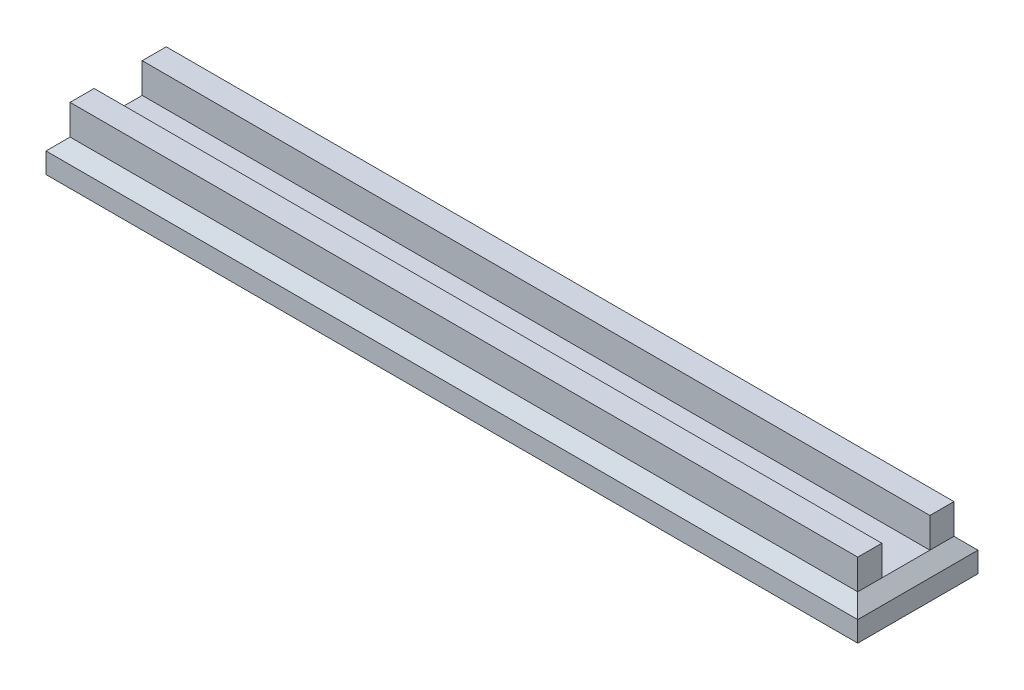
ISO-10303-21;
HEADER;
FILE_DESCRIPTION(('STEP AP214'),'2;1');
FILE_NAME('part.step','',(''),(''),'','','');
FILE_SCHEMA(('AUTOMOTIVE_DESIGN { 1 0 10303 214 1 1 1 1 }'));
ENDSEC;
DATA;
#1=APPLICATION_CONTEXT('core data for automotive mechanical design processes');
#2=APPLICATION_PROTOCOL_DEFINITION('international standard','automotive_design',2000,#1);
#3=PRODUCT_CONTEXT('',#1,'mechanical');
#4=PRODUCT('Part','Part','',(#3));
#5=PRODUCT_RELATED_PRODUCT_CATEGORY('part','',(#4));
#6=PRODUCT_DEFINITION_FORMATION('','',#4);
#7=PRODUCT_DEFINITION_CONTEXT('part definition',#1,'design');
#8=PRODUCT_DEFINITION('design','',#6,#7);
#9=PRODUCT_DEFINITION_SHAPE('','',#8);
#10=(LENGTH_UNIT() NAMED_UNIT(*) SI_UNIT(.MILLI.,.METRE.));
#11=(NAMED_UNIT(*) PLANE_ANGLE_UNIT() SI_UNIT($,.RADIAN.));
#12=(NAMED_UNIT(*) SI_UNIT($,.STERADIAN.) SOLID_ANGLE_UNIT());
#13=UNCERTAINTY_MEASURE_WITH_UNIT(LENGTH_MEASURE(1.E-05),#10,'distance_accuracy_value','');
#14=(GEOMETRIC_REPRESENTATION_CONTEXT(3) GLOBAL_UNCERTAINTY_ASSIGNED_CONTEXT((#13)) GLOBAL_UNIT_ASSIGNED_CONTEXT((#10,
#11,#12)) REPRESENTATION_CONTEXT('',''));
#15=CARTESIAN_POINT('',(0.,0.,0.));
#16=DIRECTION('',(0.,0.,1.));
#17=DIRECTION('',(1.,0.,0.));
#18=AXIS2_PLACEMENT_3D('',#15,#16,#17);
#19=CARTESIAN_POINT('',(0.,5.4,0.));
#20=DIRECTION('',(0.,-1.,0.));
#21=DIRECTION('',(0.,0.,-1.));
#22=AXIS2_PLACEMENT_3D('',#19,#20,#21);
#23=PLANE('',#22);
#24=DIRECTION('',(-1.,0.,0.));
#25=VECTOR('',#24,1.);
#26=CARTESIAN_POINT('',(-65.5,5.4,4.));
#27=LINE('',#26,#25);
#28=CARTESIAN_POINT('',(65.5,5.4,4.));
#29=VERTEX_POINT('',#28);
#30=CARTESIAN_POINT('',(-65.5,5.4,4.));
#31=VERTEX_POINT('',#30);
#32=EDGE_CURVE('E71',#29,#31,#27,.T.);
#33=ORIENTED_EDGE('',*,*,#32,.F.);
#34=DIRECTION('',(0.,0.,-1.));
#35=VECTOR('',#34,1.);
#36=CARTESIAN_POINT('',(65.5,5.4,0.));
#37=LINE('',#36,#35);
#38=CARTESIAN_POINT('',(65.5,5.4,-4.));
#39=VERTEX_POINT('',#38);
#40=EDGE_CURVE('E145',#29,#39,#37,.T.);
#41=ORIENTED_EDGE('',*,*,#40,.T.);
#42=DIRECTION('',(1.,0.,0.));
#43=VECTOR('',#42,1.);
#44=CARTESIAN_POINT('',(-65.5,5.4,-4.));
#45=LINE('',#44,#43);
#46=CARTESIAN_POINT('',(-65.5,5.4,-4.));
#47=VERTEX_POINT('',#46);
#48=EDGE_CURVE('E196',#47,#39,#45,.T.);
#49=ORIENTED_EDGE('',*,*,#48,.F.);
#50=DIRECTION('',(0.,0.,1.));
#51=VECTOR('',#50,1.);
#52=CARTESIAN_POINT('',(-65.5,5.4,0.));
#53=LINE('',#52,#51);
#54=EDGE_CURVE('E273',#47,#31,#53,.T.);
#55=ORIENTED_EDGE('',*,*,#54,.T.);
#56=EDGE_LOOP('',(#33,#41,#49,#55));
#57=FACE_BOUND('',#56,.T.);
#58=ADVANCED_FACE('F45',(#57),#23,.F.);
#59=CARTESIAN_POINT('',(67.5,5.4,10.));
#60=DIRECTION('',(-1.,0.,0.));
#61=DIRECTION('',(0.,0.,1.));
#62=AXIS2_PLACEMENT_3D('',#59,#60,#61);
#63=PLANE('',#62);
#64=DIRECTION('',(0.,-1.,0.));
#65=VECTOR('',#64,1.);
#66=CARTESIAN_POINT('',(67.5,5.4,-10.));
#67=LINE('',#66,#65);
#68=CARTESIAN_POINT('',(67.5,3.39999999999999,-10.));
#69=VERTEX_POINT('',#68);
#70=CARTESIAN_POINT('',(67.5,0.,-10.));
#71=VERTEX_POINT('',#70);
#72=EDGE_CURVE('E267',#69,#71,#67,.T.);
#73=ORIENTED_EDGE('',*,*,#72,.F.);
#74=DIRECTION('',(0.,0.,1.));
#75=VECTOR('',#74,1.);
#76=CARTESIAN_POINT('',(67.5,3.39999999999998,10.));
#77=LINE('',#76,#75);
#78=CARTESIAN_POINT('',(67.5,3.39999999999999,10.));
#79=VERTEX_POINT('',#78);
#80=EDGE_CURVE('E11',#69,#79,#77,.T.);
#81=ORIENTED_EDGE('',*,*,#80,.T.);
#82=DIRECTION('',(0.,-1.,0.));
#83=VECTOR('',#82,1.);
#84=CARTESIAN_POINT('',(67.5,5.4,10.));
#85=LINE('',#84,#83);
#86=CARTESIAN_POINT('',(67.5,0.,10.));
#87=VERTEX_POINT('',#86);
#88=EDGE_CURVE('E258',#79,#87,#85,.T.);
#89=ORIENTED_EDGE('',*,*,#88,.T.);
#90=DIRECTION('',(0.,0.,-1.));
#91=VECTOR('',#90,1.);
#92=CARTESIAN_POINT('',(67.5,0.,10.));
#93=LINE('',#92,#91);
#94=EDGE_CURVE('E242',#87,#71,#93,.T.);
#95=ORIENTED_EDGE('',*,*,#94,.T.);
#96=EDGE_LOOP('',(#73,#81,#89,#95));
#97=FACE_BOUND('',#96,.T.);
#98=ADVANCED_FACE('F301',(#97),#63,.F.);
#99=CARTESIAN_POINT('',(-67.5,5.4,-10.));
#100=DIRECTION('',(0.,0.,1.));
#101=DIRECTION('',(1.,0.,0.));
#102=AXIS2_PLACEMENT_3D('',#99,#100,#101);
#103=PLANE('',#102);
#104=DIRECTION('',(0.,-1.,0.));
#105=VECTOR('',#104,1.);
#106=CARTESIAN_POINT('',(-67.5,5.4,-10.));
#107=LINE('',#106,#105);
#108=CARTESIAN_POINT('',(-67.5,3.39999999999999,-10.));
#109=VERTEX_POINT('',#108);
#110=CARTESIAN_POINT('',(-67.5,0.,-10.));
#111=VERTEX_POINT('',#110);
#112=EDGE_CURVE('E264',#109,#111,#107,.T.);
#113=ORIENTED_EDGE('',*,*,#112,.F.);
#114=DIRECTION('',(1.,0.,0.));
#115=VECTOR('',#114,1.);
#116=CARTESIAN_POINT('',(-67.5,3.39999999999998,-10.));
#117=LINE('',#116,#115);
#118=EDGE_CURVE('E56',#109,#69,#117,.T.);
#119=ORIENTED_EDGE('',*,*,#118,.T.);
#120=ORIENTED_EDGE('',*,*,#72,.T.);
#121=DIRECTION('',(-1.,0.,0.));
#122=VECTOR('',#121,1.);
#123=CARTESIAN_POINT('',(-67.5,0.,-10.));
#124=LINE('',#123,#122);
#125=EDGE_CURVE('E246',#71,#111,#124,.T.);
#126=ORIENTED_EDGE('',*,*,#125,.T.);
#127=EDGE_LOOP('',(#113,#119,#120,#126));
#128=FACE_BOUND('',#127,.T.);
#129=ADVANCED_FACE('F298',(#128),#103,.F.);
#130=CARTESIAN_POINT('',(-67.5,5.4,10.));
#131=DIRECTION('',(1.,0.,0.));
#132=DIRECTION('',(0.,0.,-1.));
#133=AXIS2_PLACEMENT_3D('',#130,#131,#132);
#134=PLANE('',#133);
#135=DIRECTION('',(0.,-1.,0.));
#136=VECTOR('',#135,1.);
#137=CARTESIAN_POINT('',(-67.5,5.4,10.));
#138=LINE('',#137,#136);
#139=CARTESIAN_POINT('',(-67.5,3.39999999999999,10.));
#140=VERTEX_POINT('',#139);
#141=CARTESIAN_POINT('',(-67.5,0.,10.));
#142=VERTEX_POINT('',#141);
#143=EDGE_CURVE('E261',#140,#142,#138,.T.);
#144=ORIENTED_EDGE('',*,*,#143,.F.);
#145=DIRECTION('',(0.,0.,-1.));
#146=VECTOR('',#145,1.);
#147=CARTESIAN_POINT('',(-67.5,3.39999999999998,10.));
#148=LINE('',#147,#146);
#149=EDGE_CURVE('E279',#140,#109,#148,.T.);
#150=ORIENTED_EDGE('',*,*,#149,.T.);
#151=ORIENTED_EDGE('',*,*,#112,.T.);
#152=DIRECTION('',(0.,0.,1.));
#153=VECTOR('',#152,1.);
#154=CARTESIAN_POINT('',(-67.5,0.,10.));
#155=LINE('',#154,#153);
#156=EDGE_CURVE('E250',#111,#142,#155,.T.);
#157=ORIENTED_EDGE('',*,*,#156,.T.);
#158=EDGE_LOOP('',(#144,#150,#151,#157));
#159=FACE_BOUND('',#158,.T.);
#160=ADVANCED_FACE('F310',(#159),#134,.F.);
#161=CARTESIAN_POINT('',(-67.5,5.4,10.));
#162=DIRECTION('',(0.,0.,-1.));
#163=DIRECTION('',(-1.,0.,0.));
#164=AXIS2_PLACEMENT_3D('',#161,#162,#163);
#165=PLANE('',#164);
#166=ORIENTED_EDGE('',*,*,#88,.F.);
#167=DIRECTION('',(-1.,0.,0.));
#168=VECTOR('',#167,1.);
#169=CARTESIAN_POINT('',(-67.5,3.39999999999998,10.));
#170=LINE('',#169,#168);
#171=EDGE_CURVE('E161',#79,#140,#170,.T.);
#172=ORIENTED_EDGE('',*,*,#171,.T.);
#173=ORIENTED_EDGE('',*,*,#143,.T.);
#174=DIRECTION('',(1.,0.,0.));
#175=VECTOR('',#174,1.);
#176=CARTESIAN_POINT('',(-67.5,0.,10.));
#177=LINE('',#176,#175);
#178=EDGE_CURVE('E254',#142,#87,#177,.T.);
#179=ORIENTED_EDGE('',*,*,#178,.T.);
#180=EDGE_LOOP('',(#166,#172,#173,#179));
#181=FACE_BOUND('',#180,.T.);
#182=ADVANCED_FACE('F312',(#181),#165,.F.);
#183=CARTESIAN_POINT('',(0.,0.,0.));
#184=DIRECTION('',(0.,-1.,0.));
#185=DIRECTION('',(0.,0.,-1.));
#186=AXIS2_PLACEMENT_3D('',#183,#184,#185);
#187=PLANE('',#186);
#188=ORIENTED_EDGE('',*,*,#94,.F.);
#189=ORIENTED_EDGE('',*,*,#178,.F.);
#190=ORIENTED_EDGE('',*,*,#156,.F.);
#191=ORIENTED_EDGE('',*,*,#125,.F.);
#192=EDGE_LOOP('',(#188,#189,#190,#191));
#193=FACE_BOUND('',#192,.T.);
#194=ADVANCED_FACE('F306',(#193),#187,.T.);
#195=CARTESIAN_POINT('',(0.,5.4,-8.));
#196=DIRECTION('',(0.,-0.707106781186545,0.70710678118655));
#197=DIRECTION('',(-1.,0.,0.));
#198=AXIS2_PLACEMENT_3D('',#195,#196,#197);
#199=PLANE('',#198);
#200=DIRECTION('',(-0.577350269189625,0.577350269189629,0.577350269189624));
#201=VECTOR('',#200,1.);
#202=CARTESIAN_POINT('',(62.8333333333334,8.06666666666667,-5.33333333333335));
#203=LINE('',#202,#201);
#204=CARTESIAN_POINT('',(65.5,5.4,-8.));
#205=VERTEX_POINT('',#204);
#206=EDGE_CURVE('E285',#69,#205,#203,.T.);
#207=ORIENTED_EDGE('',*,*,#206,.F.);
#208=ORIENTED_EDGE('',*,*,#118,.F.);
#209=DIRECTION('',(0.577350269189625,0.577350269189629,0.577350269189624));
#210=VECTOR('',#209,1.);
#211=CARTESIAN_POINT('',(-43.6666666666667,27.2333333333334,13.8333333333332));
#212=LINE('',#211,#210);
#213=CARTESIAN_POINT('',(-65.5,5.4,-8.));
#214=VERTEX_POINT('',#213);
#215=EDGE_CURVE('E50',#214,#109,#212,.F.);
#216=ORIENTED_EDGE('',*,*,#215,.F.);
#217=DIRECTION('',(-1.,0.,0.));
#218=VECTOR('',#217,1.);
#219=CARTESIAN_POINT('',(0.,5.4,-8.));
#220=LINE('',#219,#218);
#221=EDGE_CURVE('E151',#205,#214,#220,.T.);
#222=ORIENTED_EDGE('',*,*,#221,.F.);
#223=EDGE_LOOP('',(#207,#208,#216,#222));
#224=FACE_BOUND('',#223,.T.);
#225=ADVANCED_FACE('F48',(#224),#199,.F.);
#226=CARTESIAN_POINT('',(-65.5,5.4,0.));
#227=DIRECTION('',(0.70710678118655,-0.707106781186545,0.));
#228=DIRECTION('',(0.,0.,1.));
#229=AXIS2_PLACEMENT_3D('',#226,#227,#228);
#230=PLANE('',#229);
#231=ORIENTED_EDGE('',*,*,#215,.T.);
#232=ORIENTED_EDGE('',*,*,#149,.F.);
#233=DIRECTION('',(0.577350269189625,0.577350269189629,-0.577350269189624));
#234=VECTOR('',#233,1.);
#235=CARTESIAN_POINT('',(-62.8333333333333,8.06666666666667,5.33333333333335));
#236=LINE('',#235,#234);
#237=CARTESIAN_POINT('',(-65.5,5.4,8.));
#238=VERTEX_POINT('',#237);
#239=EDGE_CURVE('E163',#238,#140,#236,.F.);
#240=ORIENTED_EDGE('',*,*,#239,.F.);
#241=DIRECTION('',(0.,0.,1.));
#242=VECTOR('',#241,1.);
#243=CARTESIAN_POINT('',(-65.5,5.4,8.));
#244=LINE('',#243,#242);
#245=EDGE_CURVE('E64',#31,#238,#244,.T.);
#246=ORIENTED_EDGE('',*,*,#245,.F.);
#247=ORIENTED_EDGE('',*,*,#54,.F.);
#248=EDGE_CURVE('E174',#214,#47,#53,.T.);
#249=ORIENTED_EDGE('',*,*,#248,.F.);
#250=EDGE_LOOP('',(#231,#232,#240,#246,#247,#249));
#251=FACE_BOUND('',#250,.T.);
#252=ADVANCED_FACE('F292',(#251),#230,.F.);
#253=CARTESIAN_POINT('',(65.5,5.4,0.));
#254=DIRECTION('',(-0.70710678118655,-0.707106781186545,0.));
#255=DIRECTION('',(0.,0.,-1.));
#256=AXIS2_PLACEMENT_3D('',#253,#254,#255);
#257=PLANE('',#256);
#258=ORIENTED_EDGE('',*,*,#206,.T.);
#259=DIRECTION('',(0.,0.,-1.));
#260=VECTOR('',#259,1.);
#261=CARTESIAN_POINT('',(65.5,5.4,-8.));
#262=LINE('',#261,#260);
#263=EDGE_CURVE('E212',#39,#205,#262,.T.);
#264=ORIENTED_EDGE('',*,*,#263,.F.);
#265=ORIENTED_EDGE('',*,*,#40,.F.);
#266=CARTESIAN_POINT('',(65.5,5.4,8.));
#267=VERTEX_POINT('',#266);
#268=EDGE_CURVE('E138',#267,#29,#37,.T.);
#269=ORIENTED_EDGE('',*,*,#268,.F.);
#270=DIRECTION('',(0.577350269189625,-0.577350269189629,0.577350269189624));
#271=VECTOR('',#270,1.);
#272=CARTESIAN_POINT('',(62.8333333333334,8.06666666666667,5.33333333333335));
#273=LINE('',#272,#271);
#274=EDGE_CURVE('E143',#79,#267,#273,.F.);
#275=ORIENTED_EDGE('',*,*,#274,.F.);
#276=ORIENTED_EDGE('',*,*,#80,.F.);
#277=EDGE_LOOP('',(#258,#264,#265,#269,#275,#276));
#278=FACE_BOUND('',#277,.T.);
#279=ADVANCED_FACE('F141',(#278),#257,.F.);
#280=CARTESIAN_POINT('',(0.,5.4,8.));
#281=DIRECTION('',(0.,-0.707106781186545,-0.70710678118655));
#282=DIRECTION('',(1.,0.,0.));
#283=AXIS2_PLACEMENT_3D('',#280,#281,#282);
#284=PLANE('',#283);
#285=ORIENTED_EDGE('',*,*,#239,.T.);
#286=ORIENTED_EDGE('',*,*,#171,.F.);
#287=ORIENTED_EDGE('',*,*,#274,.T.);
#288=DIRECTION('',(1.,0.,0.));
#289=VECTOR('',#288,1.);
#290=CARTESIAN_POINT('',(0.,5.4,8.));
#291=LINE('',#290,#289);
#292=EDGE_CURVE('E158',#238,#267,#291,.T.);
#293=ORIENTED_EDGE('',*,*,#292,.F.);
#294=EDGE_LOOP('',(#285,#286,#287,#293));
#295=FACE_BOUND('',#294,.T.);
#296=ADVANCED_FACE('F157',(#295),#284,.F.);
#297=CARTESIAN_POINT('',(-65.5,10.4,-8.));
#298=DIRECTION('',(1.,0.,0.));
#299=DIRECTION('',(0.,0.,-1.));
#300=AXIS2_PLACEMENT_3D('',#297,#298,#299);
#301=PLANE('',#300);
#302=ORIENTED_EDGE('',*,*,#248,.T.);
#303=DIRECTION('',(0.,-1.,0.));
#304=VECTOR('',#303,1.);
#305=CARTESIAN_POINT('',(-65.5,10.4,-4.));
#306=LINE('',#305,#304);
#307=CARTESIAN_POINT('',(-65.5,10.4,-4.));
#308=VERTEX_POINT('',#307);
#309=EDGE_CURVE('E164',#308,#47,#306,.T.);
#310=ORIENTED_EDGE('',*,*,#309,.F.);
#311=DIRECTION('',(0.,0.,1.));
#312=VECTOR('',#311,1.);
#313=CARTESIAN_POINT('',(-65.5,10.4,-8.));
#314=LINE('',#313,#312);
#315=CARTESIAN_POINT('',(-65.5,10.4,-8.));
#316=VERTEX_POINT('',#315);
#317=EDGE_CURVE('E207',#316,#308,#314,.T.);
#318=ORIENTED_EDGE('',*,*,#317,.F.);
#319=DIRECTION('',(0.,-1.,0.));
#320=VECTOR('',#319,1.);
#321=CARTESIAN_POINT('',(-65.5,10.4,-8.));
#322=LINE('',#321,#320);
#323=EDGE_CURVE('E221',#316,#214,#322,.T.);
#324=ORIENTED_EDGE('',*,*,#323,.T.);
#325=EDGE_LOOP('',(#302,#310,#318,#324));
#326=FACE_BOUND('',#325,.T.);
#327=ADVANCED_FACE('F328',(#326),#301,.F.);
#328=CARTESIAN_POINT('',(-65.5,10.4,-4.));
#329=DIRECTION('',(0.,0.,-1.));
#330=DIRECTION('',(-1.,0.,0.));
#331=AXIS2_PLACEMENT_3D('',#328,#329,#330);
#332=PLANE('',#331);
#333=ORIENTED_EDGE('',*,*,#48,.T.);
#334=DIRECTION('',(0.,-1.,0.));
#335=VECTOR('',#334,1.);
#336=CARTESIAN_POINT('',(65.5,10.4,-4.));
#337=LINE('',#336,#335);
#338=CARTESIAN_POINT('',(65.5,10.4,-4.));
#339=VERTEX_POINT('',#338);
#340=EDGE_CURVE('E235',#339,#39,#337,.T.);
#341=ORIENTED_EDGE('',*,*,#340,.F.);
#342=DIRECTION('',(1.,0.,0.));
#343=VECTOR('',#342,1.);
#344=CARTESIAN_POINT('',(-65.5,10.4,-4.));
#345=LINE('',#344,#343);
#346=EDGE_CURVE('E211',#308,#339,#345,.T.);
#347=ORIENTED_EDGE('',*,*,#346,.F.);
#348=ORIENTED_EDGE('',*,*,#309,.T.);
#349=EDGE_LOOP('',(#333,#341,#347,#348));
#350=FACE_BOUND('',#349,.T.);
#351=ADVANCED_FACE('F331',(#350),#332,.F.);
#352=CARTESIAN_POINT('',(65.5,10.4,-8.));
#353=DIRECTION('',(-1.,0.,0.));
#354=DIRECTION('',(0.,0.,1.));
#355=AXIS2_PLACEMENT_3D('',#352,#353,#354);
#356=PLANE('',#355);
#357=ORIENTED_EDGE('',*,*,#263,.T.);
#358=DIRECTION('',(0.,-1.,0.));
#359=VECTOR('',#358,1.);
#360=CARTESIAN_POINT('',(65.5,10.4,-8.));
#361=LINE('',#360,#359);
#362=CARTESIAN_POINT('',(65.5,10.4,-8.));
#363=VERTEX_POINT('',#362);
#364=EDGE_CURVE('E231',#363,#205,#361,.T.);
#365=ORIENTED_EDGE('',*,*,#364,.F.);
#366=DIRECTION('',(0.,0.,-1.));
#367=VECTOR('',#366,1.);
#368=CARTESIAN_POINT('',(65.5,10.4,-8.));
#369=LINE('',#368,#367);
#370=EDGE_CURVE('E215',#339,#363,#369,.T.);
#371=ORIENTED_EDGE('',*,*,#370,.F.);
#372=ORIENTED_EDGE('',*,*,#340,.T.);
#373=EDGE_LOOP('',(#357,#365,#371,#372));
#374=FACE_BOUND('',#373,.T.);
#375=ADVANCED_FACE('F335',(#374),#356,.F.);
#376=CARTESIAN_POINT('',(-65.5,10.4,-8.));
#377=DIRECTION('',(0.,0.,1.));
#378=DIRECTION('',(1.,0.,0.));
#379=AXIS2_PLACEMENT_3D('',#376,#377,#378);
#380=PLANE('',#379);
#381=ORIENTED_EDGE('',*,*,#221,.T.);
#382=ORIENTED_EDGE('',*,*,#323,.F.);
#383=DIRECTION('',(-1.,0.,0.));
#384=VECTOR('',#383,1.);
#385=CARTESIAN_POINT('',(-65.5,10.4,-8.));
#386=LINE('',#385,#384);
#387=EDGE_CURVE('E218',#363,#316,#386,.T.);
#388=ORIENTED_EDGE('',*,*,#387,.F.);
#389=ORIENTED_EDGE('',*,*,#364,.T.);
#390=EDGE_LOOP('',(#381,#382,#388,#389));
#391=FACE_BOUND('',#390,.T.);
#392=ADVANCED_FACE('F339',(#391),#380,.F.);
#393=CARTESIAN_POINT('',(0.,10.4,0.));
#394=DIRECTION('',(0.,1.,0.));
#395=DIRECTION('',(0.,0.,1.));
#396=AXIS2_PLACEMENT_3D('',#393,#394,#395);
#397=PLANE('',#396);
#398=ORIENTED_EDGE('',*,*,#317,.T.);
#399=ORIENTED_EDGE('',*,*,#346,.T.);
#400=ORIENTED_EDGE('',*,*,#370,.T.);
#401=ORIENTED_EDGE('',*,*,#387,.T.);
#402=EDGE_LOOP('',(#398,#399,#400,#401));
#403=FACE_BOUND('',#402,.T.);
#404=ADVANCED_FACE('F343',(#403),#397,.T.);
#405=CARTESIAN_POINT('',(-65.5,10.4,8.));
#406=DIRECTION('',(1.,0.,0.));
#407=DIRECTION('',(0.,0.,-1.));
#408=AXIS2_PLACEMENT_3D('',#405,#406,#407);
#409=PLANE('',#408);
#410=ORIENTED_EDGE('',*,*,#245,.T.);
#411=DIRECTION('',(0.,-1.,0.));
#412=VECTOR('',#411,1.);
#413=CARTESIAN_POINT('',(-65.5,10.4,8.));
#414=LINE('',#413,#412);
#415=CARTESIAN_POINT('',(-65.5,10.4,8.));
#416=VERTEX_POINT('',#415);
#417=EDGE_CURVE('E172',#416,#238,#414,.T.);
#418=ORIENTED_EDGE('',*,*,#417,.F.);
#419=DIRECTION('',(0.,0.,1.));
#420=VECTOR('',#419,1.);
#421=CARTESIAN_POINT('',(-65.5,10.4,8.));
#422=LINE('',#421,#420);
#423=CARTESIAN_POINT('',(-65.5,10.4,4.));
#424=VERTEX_POINT('',#423);
#425=EDGE_CURVE('E193',#424,#416,#422,.T.);
#426=ORIENTED_EDGE('',*,*,#425,.F.);
#427=DIRECTION('',(0.,-1.,0.));
#428=VECTOR('',#427,1.);
#429=CARTESIAN_POINT('',(-65.5,10.4,4.));
#430=LINE('',#429,#428);
#431=EDGE_CURVE('E183',#424,#31,#430,.T.);
#432=ORIENTED_EDGE('',*,*,#431,.T.);
#433=EDGE_LOOP('',(#410,#418,#426,#432));
#434=FACE_BOUND('',#433,.T.);
#435=ADVANCED_FACE('F347',(#434),#409,.F.);
#436=CARTESIAN_POINT('',(-65.5,10.4,8.));
#437=DIRECTION('',(0.,0.,-1.));
#438=DIRECTION('',(-1.,0.,0.));
#439=AXIS2_PLACEMENT_3D('',#436,#437,#438);
#440=PLANE('',#439);
#441=ORIENTED_EDGE('',*,*,#292,.T.);
#442=DIRECTION('',(0.,-1.,0.));
#443=VECTOR('',#442,1.);
#444=CARTESIAN_POINT('',(65.5,10.4,8.));
#445=LINE('',#444,#443);
#446=CARTESIAN_POINT('',(65.5,10.4,8.));
#447=VERTEX_POINT('',#446);
#448=EDGE_CURVE('E169',#447,#267,#445,.T.);
#449=ORIENTED_EDGE('',*,*,#448,.F.);
#450=DIRECTION('',(1.,0.,0.));
#451=VECTOR('',#450,1.);
#452=CARTESIAN_POINT('',(-65.5,10.4,8.));
#453=LINE('',#452,#451);
#454=EDGE_CURVE('E201',#416,#447,#453,.T.);
#455=ORIENTED_EDGE('',*,*,#454,.F.);
#456=ORIENTED_EDGE('',*,*,#417,.T.);
#457=EDGE_LOOP('',(#441,#449,#455,#456));
#458=FACE_BOUND('',#457,.T.);
#459=ADVANCED_FACE('F168',(#458),#440,.F.);
#460=CARTESIAN_POINT('',(65.5,10.4,8.));
#461=DIRECTION('',(-1.,0.,0.));
#462=DIRECTION('',(0.,0.,1.));
#463=AXIS2_PLACEMENT_3D('',#460,#461,#462);
#464=PLANE('',#463);
#465=ORIENTED_EDGE('',*,*,#268,.T.);
#466=DIRECTION('',(0.,-1.,0.));
#467=VECTOR('',#466,1.);
#468=CARTESIAN_POINT('',(65.5,10.4,4.));
#469=LINE('',#468,#467);
#470=CARTESIAN_POINT('',(65.5,10.4,4.));
#471=VERTEX_POINT('',#470);
#472=EDGE_CURVE('E179',#471,#29,#469,.T.);
#473=ORIENTED_EDGE('',*,*,#472,.F.);
#474=DIRECTION('',(0.,0.,-1.));
#475=VECTOR('',#474,1.);
#476=CARTESIAN_POINT('',(65.5,10.4,8.));
#477=LINE('',#476,#475);
#478=EDGE_CURVE('E177',#447,#471,#477,.T.);
#479=ORIENTED_EDGE('',*,*,#478,.F.);
#480=ORIENTED_EDGE('',*,*,#448,.T.);
#481=EDGE_LOOP('',(#465,#473,#479,#480));
#482=FACE_BOUND('',#481,.T.);
#483=ADVANCED_FACE('F176',(#482),#464,.F.);
#484=CARTESIAN_POINT('',(-65.5,10.4,4.));
#485=DIRECTION('',(0.,0.,1.));
#486=DIRECTION('',(1.,0.,0.));
#487=AXIS2_PLACEMENT_3D('',#484,#485,#486);
#488=PLANE('',#487);
#489=ORIENTED_EDGE('',*,*,#32,.T.);
#490=ORIENTED_EDGE('',*,*,#431,.F.);
#491=DIRECTION('',(-1.,0.,0.));
#492=VECTOR('',#491,1.);
#493=CARTESIAN_POINT('',(-65.5,10.4,4.));
#494=LINE('',#493,#492);
#495=EDGE_CURVE('E190',#471,#424,#494,.T.);
#496=ORIENTED_EDGE('',*,*,#495,.F.);
#497=ORIENTED_EDGE('',*,*,#472,.T.);
#498=EDGE_LOOP('',(#489,#490,#496,#497));
#499=FACE_BOUND('',#498,.T.);
#500=ADVANCED_FACE('F352',(#499),#488,.F.);
#501=CARTESIAN_POINT('',(0.,10.4,0.));
#502=DIRECTION('',(0.,-1.,0.));
#503=DIRECTION('',(0.,0.,-1.));
#504=AXIS2_PLACEMENT_3D('',#501,#502,#503);
#505=PLANE('',#504);
#506=ORIENTED_EDGE('',*,*,#425,.T.);
#507=ORIENTED_EDGE('',*,*,#454,.T.);
#508=ORIENTED_EDGE('',*,*,#478,.T.);
#509=ORIENTED_EDGE('',*,*,#495,.T.);
#510=EDGE_LOOP('',(#506,#507,#508,#509));
#511=FACE_BOUND('',#510,.T.);
#512=ADVANCED_FACE('F349',(#511),#505,.F.);
#513=CLOSED_SHELL('',(#58,#98,#129,#160,#182,#194,#225,#252,#279,#296,#327,#351,#375,#392,#404,
#435,#459,#483,#500,#512));
#514=MANIFOLD_SOLID_BREP('B2',#513);
#515=ADVANCED_BREP_SHAPE_REPRESENTATION('',(#18,#514),#14);
#516=SHAPE_DEFINITION_REPRESENTATION(#9,#515);
ENDSEC;
END-ISO-10303-21;
